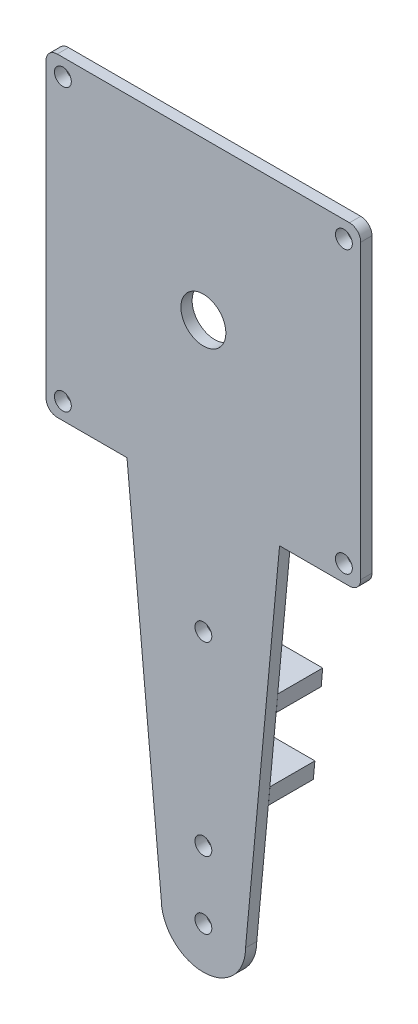
ISO-10303-21;
HEADER;
FILE_DESCRIPTION(('STEP AP214'),'2;1');
FILE_NAME('part.step','',(''),(''),'','','');
FILE_SCHEMA(('AUTOMOTIVE_DESIGN { 1 0 10303 214 1 1 1 1 }'));
ENDSEC;
DATA;
#1=APPLICATION_CONTEXT('core data for automotive mechanical design processes');
#2=APPLICATION_PROTOCOL_DEFINITION('international standard','automotive_design',2000,#1);
#3=PRODUCT_CONTEXT('',#1,'mechanical');
#4=PRODUCT('Part','Part','',(#3));
#5=PRODUCT_RELATED_PRODUCT_CATEGORY('part','',(#4));
#6=PRODUCT_DEFINITION_FORMATION('','',#4);
#7=PRODUCT_DEFINITION_CONTEXT('part definition',#1,'design');
#8=PRODUCT_DEFINITION('design','',#6,#7);
#9=PRODUCT_DEFINITION_SHAPE('','',#8);
#10=(LENGTH_UNIT() NAMED_UNIT(*) SI_UNIT(.MILLI.,.METRE.));
#11=(NAMED_UNIT(*) PLANE_ANGLE_UNIT() SI_UNIT($,.RADIAN.));
#12=(NAMED_UNIT(*) SI_UNIT($,.STERADIAN.) SOLID_ANGLE_UNIT());
#13=UNCERTAINTY_MEASURE_WITH_UNIT(LENGTH_MEASURE(1.E-05),#10,'distance_accuracy_value','');
#14=(GEOMETRIC_REPRESENTATION_CONTEXT(3) GLOBAL_UNCERTAINTY_ASSIGNED_CONTEXT((#13)) GLOBAL_UNIT_ASSIGNED_CONTEXT((#10,
#11,#12)) REPRESENTATION_CONTEXT('',''));
#15=CARTESIAN_POINT('',(0.,0.,0.));
#16=DIRECTION('',(0.,0.,1.));
#17=DIRECTION('',(1.,0.,0.));
#18=AXIS2_PLACEMENT_3D('',#15,#16,#17);
#19=CARTESIAN_POINT('',(26.,26.,0.));
#20=DIRECTION('',(0.,0.,1.));
#21=DIRECTION('',(1.,0.,0.));
#22=AXIS2_PLACEMENT_3D('',#19,#20,#21);
#23=PLANE('',#22);
#24=DIRECTION('',(1.,0.,0.));
#25=VECTOR('',#24,1.);
#26=CARTESIAN_POINT('',(-9.84374999999999,-68.,0.));
#27=LINE('',#26,#25);
#28=CARTESIAN_POINT('',(-9.84374999999999,-68.,0.));
#29=VERTEX_POINT('',#28);
#30=CARTESIAN_POINT('',(9.8291001850641,-68.,0.));
#31=VERTEX_POINT('',#30);
#32=EDGE_CURVE('E55',#29,#31,#27,.T.);
#33=ORIENTED_EDGE('',*,*,#32,.F.);
#34=DIRECTION('',(0.0933407086930583,-0.995634226059288,0.));
#35=VECTOR('',#34,1.);
#36=CARTESIAN_POINT('',(-7.49999999999999,-93.,0.));
#37=LINE('',#36,#35);
#38=CARTESIAN_POINT('',(-10.96875,-56.,0.));
#39=VERTEX_POINT('',#38);
#40=EDGE_CURVE('E215',#39,#29,#37,.T.);
#41=ORIENTED_EDGE('',*,*,#40,.F.);
#42=DIRECTION('',(-1.,0.,0.));
#43=VECTOR('',#42,1.);
#44=CARTESIAN_POINT('',(10.96875,-56.,0.));
#45=LINE('',#44,#43);
#46=CARTESIAN_POINT('',(10.9470682738949,-56.,0.));
#47=VERTEX_POINT('',#46);
#48=EDGE_CURVE('E11',#47,#39,#45,.T.);
#49=ORIENTED_EDGE('',*,*,#48,.F.);
#50=DIRECTION('',(0.0927623104212423,0.995688281424118,0.));
#51=VECTOR('',#50,1.);
#52=CARTESIAN_POINT('',(7.50000000000001,-93.,0.));
#53=LINE('',#52,#51);
#54=EDGE_CURVE('E233',#31,#47,#53,.T.);
#55=ORIENTED_EDGE('',*,*,#54,.F.);
#56=EDGE_LOOP('',(#33,#41,#49,#55));
#57=FACE_BOUND('',#56,.T.);
#58=ADVANCED_FACE('F37',(#57),#23,.F.);
#59=CARTESIAN_POINT('',(0.,-93.,0.));
#60=DIRECTION('',(0.,0.,1.));
#61=DIRECTION('',(1.,0.,0.));
#62=AXIS2_PLACEMENT_3D('',#59,#60,#61);
#63=CIRCLE('',#62,1.5);
#64=CARTESIAN_POINT('',(1.50000000000001,-93.,0.));
#65=VERTEX_POINT('',#64);
#66=EDGE_CURVE('E208',#65,#65,#63,.F.);
#67=ORIENTED_EDGE('',*,*,#66,.F.);
#68=EDGE_LOOP('',(#67));
#69=FACE_BOUND('',#68,.T.);
#70=CARTESIAN_POINT('',(0.,-81.,0.));
#71=DIRECTION('',(0.,0.,-1.));
#72=DIRECTION('',(-1.,0.,0.));
#73=AXIS2_PLACEMENT_3D('',#70,#71,#72);
#74=CIRCLE('',#73,1.5);
#75=CARTESIAN_POINT('',(-1.49999999999998,-81.,0.));
#76=VERTEX_POINT('',#75);
#77=EDGE_CURVE('E804',#76,#76,#74,.T.);
#78=ORIENTED_EDGE('',*,*,#77,.F.);
#79=EDGE_LOOP('',(#78));
#80=FACE_BOUND('',#79,.T.);
#81=CARTESIAN_POINT('',(7.50000000000001,-93.,0.));
#82=VERTEX_POINT('',#81);
#83=CARTESIAN_POINT('',(9.54960816285641,-71.,0.));
#84=VERTEX_POINT('',#83);
#85=EDGE_CURVE('E207',#82,#84,#53,.T.);
#86=ORIENTED_EDGE('',*,*,#85,.F.);
#87=CARTESIAN_POINT('',(0.,-93.,0.));
#88=DIRECTION('',(0.,0.,-1.));
#89=DIRECTION('',(-1.,0.,0.));
#90=AXIS2_PLACEMENT_3D('',#87,#88,#89);
#91=CIRCLE('',#90,7.5);
#92=CARTESIAN_POINT('',(-7.49999999999999,-93.,0.));
#93=VERTEX_POINT('',#92);
#94=EDGE_CURVE('E189',#82,#93,#91,.T.);
#95=ORIENTED_EDGE('',*,*,#94,.T.);
#96=CARTESIAN_POINT('',(-9.56249999999999,-71.,0.));
#97=VERTEX_POINT('',#96);
#98=EDGE_CURVE('E205',#97,#93,#37,.T.);
#99=ORIENTED_EDGE('',*,*,#98,.F.);
#100=DIRECTION('',(-1.,0.,0.));
#101=VECTOR('',#100,1.);
#102=CARTESIAN_POINT('',(9.56250000000001,-71.,0.));
#103=LINE('',#102,#101);
#104=EDGE_CURVE('E830',#84,#97,#103,.T.);
#105=ORIENTED_EDGE('',*,*,#104,.F.);
#106=EDGE_LOOP('',(#86,#95,#99,#105));
#107=FACE_BOUND('',#106,.T.);
#108=ADVANCED_FACE('F203',(#69,#80,#107),#23,.F.);
#109=CARTESIAN_POINT('',(0.,-48.,0.));
#110=DIRECTION('',(0.,0.,-1.));
#111=DIRECTION('',(-1.,0.,0.));
#112=AXIS2_PLACEMENT_3D('',#109,#110,#111);
#113=CIRCLE('',#112,1.5);
#114=CARTESIAN_POINT('',(-1.49999999999999,-48.,0.));
#115=VERTEX_POINT('',#114);
#116=EDGE_CURVE('E808',#115,#115,#113,.T.);
#117=ORIENTED_EDGE('',*,*,#116,.F.);
#118=EDGE_LOOP('',(#117));
#119=FACE_BOUND('',#118,.T.);
#120=CARTESIAN_POINT('',(-25.,25.,0.));
#121=DIRECTION('',(0.,0.,1.));
#122=DIRECTION('',(1.,0.,0.));
#123=AXIS2_PLACEMENT_3D('',#120,#121,#122);
#124=CIRCLE('',#123,1.5);
#125=CARTESIAN_POINT('',(-23.5,25.,0.));
#126=VERTEX_POINT('',#125);
#127=EDGE_CURVE('E279',#126,#126,#124,.T.);
#128=ORIENTED_EDGE('',*,*,#127,.T.);
#129=EDGE_LOOP('',(#128));
#130=FACE_BOUND('',#129,.T.);
#131=CARTESIAN_POINT('',(-25.,-25.,0.));
#132=DIRECTION('',(0.,0.,1.));
#133=DIRECTION('',(1.,0.,0.));
#134=AXIS2_PLACEMENT_3D('',#131,#132,#133);
#135=CIRCLE('',#134,1.5);
#136=CARTESIAN_POINT('',(-23.5,-25.,0.));
#137=VERTEX_POINT('',#136);
#138=EDGE_CURVE('E278',#137,#137,#135,.T.);
#139=ORIENTED_EDGE('',*,*,#138,.T.);
#140=EDGE_LOOP('',(#139));
#141=FACE_BOUND('',#140,.T.);
#142=CARTESIAN_POINT('',(25.,-25.,0.));
#143=DIRECTION('',(0.,0.,1.));
#144=DIRECTION('',(1.,0.,0.));
#145=AXIS2_PLACEMENT_3D('',#142,#143,#144);
#146=CIRCLE('',#145,1.5);
#147=CARTESIAN_POINT('',(26.5,-25.,0.));
#148=VERTEX_POINT('',#147);
#149=EDGE_CURVE('E285',#148,#148,#146,.T.);
#150=ORIENTED_EDGE('',*,*,#149,.T.);
#151=EDGE_LOOP('',(#150));
#152=FACE_BOUND('',#151,.T.);
#153=CARTESIAN_POINT('',(25.,25.,0.));
#154=DIRECTION('',(0.,0.,1.));
#155=DIRECTION('',(1.,0.,0.));
#156=AXIS2_PLACEMENT_3D('',#153,#154,#155);
#157=CIRCLE('',#156,1.5);
#158=CARTESIAN_POINT('',(26.5,25.,0.));
#159=VERTEX_POINT('',#158);
#160=EDGE_CURVE('E291',#159,#159,#157,.T.);
#161=ORIENTED_EDGE('',*,*,#160,.T.);
#162=EDGE_LOOP('',(#161));
#163=FACE_BOUND('',#162,.T.);
#164=CARTESIAN_POINT('',(0.,0.,0.));
#165=DIRECTION('',(0.,0.,1.));
#166=DIRECTION('',(1.,0.,0.));
#167=AXIS2_PLACEMENT_3D('',#164,#165,#166);
#168=CIRCLE('',#167,4.);
#169=CARTESIAN_POINT('',(4.,0.,0.));
#170=VERTEX_POINT('',#169);
#171=EDGE_CURVE('E41',#170,#170,#168,.T.);
#172=ORIENTED_EDGE('',*,*,#171,.T.);
#173=EDGE_LOOP('',(#172));
#174=FACE_BOUND('',#173,.T.);
#175=DIRECTION('',(1.,0.,0.));
#176=VECTOR('',#175,1.);
#177=CARTESIAN_POINT('',(-11.25,-53.,0.));
#178=LINE('',#177,#176);
#179=CARTESIAN_POINT('',(-11.25,-53.,0.));
#180=VERTEX_POINT('',#179);
#181=CARTESIAN_POINT('',(11.226560296088,-53.0000000001623,0.));
#182=VERTEX_POINT('',#181);
#183=EDGE_CURVE('E63',#180,#182,#178,.T.);
#184=ORIENTED_EDGE('',*,*,#183,.F.);
#185=CARTESIAN_POINT('',(-13.59375,-28.,0.));
#186=VERTEX_POINT('',#185);
#187=EDGE_CURVE('E218',#186,#180,#37,.T.);
#188=ORIENTED_EDGE('',*,*,#187,.F.);
#189=DIRECTION('',(1.,0.,0.));
#190=VECTOR('',#189,1.);
#191=CARTESIAN_POINT('',(-13.59375,-28.,0.));
#192=LINE('',#191,#190);
#193=CARTESIAN_POINT('',(-26.,-28.,0.));
#194=VERTEX_POINT('',#193);
#195=EDGE_CURVE('E216',#194,#186,#192,.T.);
#196=ORIENTED_EDGE('',*,*,#195,.F.);
#197=CARTESIAN_POINT('',(-26.,-26.,0.));
#198=DIRECTION('',(0.,0.,1.));
#199=DIRECTION('',(-1.,0.,0.));
#200=AXIS2_PLACEMENT_3D('',#197,#198,#199);
#201=CIRCLE('',#200,2.);
#202=CARTESIAN_POINT('',(-28.,-26.,0.));
#203=VERTEX_POINT('',#202);
#204=EDGE_CURVE('E220',#203,#194,#201,.T.);
#205=ORIENTED_EDGE('',*,*,#204,.F.);
#206=DIRECTION('',(0.,-1.,0.));
#207=VECTOR('',#206,1.);
#208=CARTESIAN_POINT('',(-28.,26.,0.));
#209=LINE('',#208,#207);
#210=CARTESIAN_POINT('',(-28.,26.,0.));
#211=VERTEX_POINT('',#210);
#212=EDGE_CURVE('E331',#211,#203,#209,.T.);
#213=ORIENTED_EDGE('',*,*,#212,.F.);
#214=CARTESIAN_POINT('',(-26.,26.,0.));
#215=DIRECTION('',(0.,0.,1.));
#216=DIRECTION('',(-1.,0.,0.));
#217=AXIS2_PLACEMENT_3D('',#214,#215,#216);
#218=CIRCLE('',#217,2.);
#219=CARTESIAN_POINT('',(-26.,28.,0.));
#220=VERTEX_POINT('',#219);
#221=EDGE_CURVE('E329',#220,#211,#218,.T.);
#222=ORIENTED_EDGE('',*,*,#221,.F.);
#223=DIRECTION('',(-1.,0.,0.));
#224=VECTOR('',#223,1.);
#225=CARTESIAN_POINT('',(26.,28.,0.));
#226=LINE('',#225,#224);
#227=CARTESIAN_POINT('',(26.,28.,0.));
#228=VERTEX_POINT('',#227);
#229=EDGE_CURVE('E327',#228,#220,#226,.T.);
#230=ORIENTED_EDGE('',*,*,#229,.F.);
#231=CARTESIAN_POINT('',(26.,26.,0.));
#232=DIRECTION('',(0.,0.,1.));
#233=DIRECTION('',(1.,0.,0.));
#234=AXIS2_PLACEMENT_3D('',#231,#232,#233);
#235=CIRCLE('',#234,2.);
#236=CARTESIAN_POINT('',(28.,26.,0.));
#237=VERTEX_POINT('',#236);
#238=EDGE_CURVE('E297',#237,#228,#235,.T.);
#239=ORIENTED_EDGE('',*,*,#238,.F.);
#240=DIRECTION('',(0.,1.,0.));
#241=VECTOR('',#240,1.);
#242=CARTESIAN_POINT('',(28.,26.,0.));
#243=LINE('',#242,#241);
#244=CARTESIAN_POINT('',(28.,-26.,0.));
#245=VERTEX_POINT('',#244);
#246=EDGE_CURVE('E304',#245,#237,#243,.T.);
#247=ORIENTED_EDGE('',*,*,#246,.F.);
#248=CARTESIAN_POINT('',(26.,-26.,0.));
#249=DIRECTION('',(0.,0.,1.));
#250=DIRECTION('',(-1.,0.,0.));
#251=AXIS2_PLACEMENT_3D('',#248,#249,#250);
#252=CIRCLE('',#251,2.);
#253=CARTESIAN_POINT('',(26.,-28.,0.));
#254=VERTEX_POINT('',#253);
#255=EDGE_CURVE('E791',#254,#245,#252,.T.);
#256=ORIENTED_EDGE('',*,*,#255,.F.);
#257=DIRECTION('',(1.,0.,0.));
#258=VECTOR('',#257,1.);
#259=CARTESIAN_POINT('',(26.,-28.,0.));
#260=LINE('',#259,#258);
#261=CARTESIAN_POINT('',(13.5556604811666,-28.,0.));
#262=VERTEX_POINT('',#261);
#263=EDGE_CURVE('E236',#262,#254,#260,.T.);
#264=ORIENTED_EDGE('',*,*,#263,.F.);
#265=EDGE_CURVE('E223',#182,#262,#53,.T.);
#266=ORIENTED_EDGE('',*,*,#265,.F.);
#267=EDGE_LOOP('',(#184,#188,#196,#205,#213,#222,#230,#239,#247,#256,#264,#266));
#268=FACE_BOUND('',#267,.T.);
#269=ADVANCED_FACE('F350',(#119,#130,#141,#152,#163,#174,#268),#23,.F.);
#270=CARTESIAN_POINT('',(26.,26.,2.));
#271=DIRECTION('',(0.,0.,1.));
#272=DIRECTION('',(1.,0.,0.));
#273=AXIS2_PLACEMENT_3D('',#270,#271,#272);
#274=PLANE('',#273);
#275=CARTESIAN_POINT('',(0.,-93.,2.));
#276=DIRECTION('',(0.,0.,1.));
#277=DIRECTION('',(1.,0.,0.));
#278=AXIS2_PLACEMENT_3D('',#275,#276,#277);
#279=CIRCLE('',#278,1.5);
#280=CARTESIAN_POINT('',(1.50000000000001,-93.,2.));
#281=VERTEX_POINT('',#280);
#282=EDGE_CURVE('E889',#281,#281,#279,.T.);
#283=ORIENTED_EDGE('',*,*,#282,.F.);
#284=EDGE_LOOP('',(#283));
#285=FACE_BOUND('',#284,.T.);
#286=DIRECTION('',(0.0933407086930583,-0.995634226059288,0.));
#287=VECTOR('',#286,1.);
#288=CARTESIAN_POINT('',(-7.49999999999999,-93.,2.));
#289=LINE('',#288,#287);
#290=CARTESIAN_POINT('',(-13.59375,-28.,2.));
#291=VERTEX_POINT('',#290);
#292=CARTESIAN_POINT('',(-7.49999999999999,-93.,2.));
#293=VERTEX_POINT('',#292);
#294=EDGE_CURVE('E314',#291,#293,#289,.T.);
#295=ORIENTED_EDGE('',*,*,#294,.T.);
#296=CARTESIAN_POINT('',(0.,-93.,2.));
#297=DIRECTION('',(0.,0.,1.));
#298=DIRECTION('',(1.,0.,0.));
#299=AXIS2_PLACEMENT_3D('',#296,#297,#298);
#300=CIRCLE('',#299,7.5);
#301=CARTESIAN_POINT('',(7.50000000000001,-93.,2.));
#302=VERTEX_POINT('',#301);
#303=EDGE_CURVE('E192',#302,#293,#300,.F.);
#304=ORIENTED_EDGE('',*,*,#303,.F.);
#305=DIRECTION('',(0.0927623104212423,0.995688281424118,0.));
#306=VECTOR('',#305,1.);
#307=CARTESIAN_POINT('',(7.50000000000001,-93.,2.));
#308=LINE('',#307,#306);
#309=CARTESIAN_POINT('',(13.5556604811666,-28.,2.));
#310=VERTEX_POINT('',#309);
#311=EDGE_CURVE('E316',#302,#310,#308,.T.);
#312=ORIENTED_EDGE('',*,*,#311,.T.);
#313=DIRECTION('',(1.,0.,0.));
#314=VECTOR('',#313,1.);
#315=CARTESIAN_POINT('',(26.,-28.,2.));
#316=LINE('',#315,#314);
#317=CARTESIAN_POINT('',(26.,-28.,2.));
#318=VERTEX_POINT('',#317);
#319=EDGE_CURVE('E318',#310,#318,#316,.T.);
#320=ORIENTED_EDGE('',*,*,#319,.T.);
#321=CARTESIAN_POINT('',(26.,-26.,2.));
#322=DIRECTION('',(0.,0.,1.));
#323=DIRECTION('',(-1.,0.,0.));
#324=AXIS2_PLACEMENT_3D('',#321,#322,#323);
#325=CIRCLE('',#324,2.);
#326=CARTESIAN_POINT('',(28.,-26.,2.));
#327=VERTEX_POINT('',#326);
#328=EDGE_CURVE('E320',#318,#327,#325,.T.);
#329=ORIENTED_EDGE('',*,*,#328,.T.);
#330=DIRECTION('',(0.,1.,0.));
#331=VECTOR('',#330,1.);
#332=CARTESIAN_POINT('',(28.,26.,2.));
#333=LINE('',#332,#331);
#334=CARTESIAN_POINT('',(28.,26.,2.));
#335=VERTEX_POINT('',#334);
#336=EDGE_CURVE('E322',#327,#335,#333,.T.);
#337=ORIENTED_EDGE('',*,*,#336,.T.);
#338=CARTESIAN_POINT('',(26.,26.,2.));
#339=DIRECTION('',(0.,0.,1.));
#340=DIRECTION('',(1.,0.,0.));
#341=AXIS2_PLACEMENT_3D('',#338,#339,#340);
#342=CIRCLE('',#341,2.);
#343=CARTESIAN_POINT('',(26.,28.,2.));
#344=VERTEX_POINT('',#343);
#345=EDGE_CURVE('E300',#335,#344,#342,.T.);
#346=ORIENTED_EDGE('',*,*,#345,.T.);
#347=DIRECTION('',(-1.,0.,0.));
#348=VECTOR('',#347,1.);
#349=CARTESIAN_POINT('',(26.,28.,2.));
#350=LINE('',#349,#348);
#351=CARTESIAN_POINT('',(-26.,28.,2.));
#352=VERTEX_POINT('',#351);
#353=EDGE_CURVE('E303',#344,#352,#350,.T.);
#354=ORIENTED_EDGE('',*,*,#353,.T.);
#355=CARTESIAN_POINT('',(-26.,26.,2.));
#356=DIRECTION('',(0.,0.,1.));
#357=DIRECTION('',(-1.,0.,0.));
#358=AXIS2_PLACEMENT_3D('',#355,#356,#357);
#359=CIRCLE('',#358,2.);
#360=CARTESIAN_POINT('',(-28.,26.,2.));
#361=VERTEX_POINT('',#360);
#362=EDGE_CURVE('E306',#352,#361,#359,.T.);
#363=ORIENTED_EDGE('',*,*,#362,.T.);
#364=DIRECTION('',(0.,-1.,0.));
#365=VECTOR('',#364,1.);
#366=CARTESIAN_POINT('',(-28.,26.,2.));
#367=LINE('',#366,#365);
#368=CARTESIAN_POINT('',(-28.,-26.,2.));
#369=VERTEX_POINT('',#368);
#370=EDGE_CURVE('E308',#361,#369,#367,.T.);
#371=ORIENTED_EDGE('',*,*,#370,.T.);
#372=CARTESIAN_POINT('',(-26.,-26.,2.));
#373=DIRECTION('',(0.,0.,1.));
#374=DIRECTION('',(-1.,0.,0.));
#375=AXIS2_PLACEMENT_3D('',#372,#373,#374);
#376=CIRCLE('',#375,2.);
#377=CARTESIAN_POINT('',(-26.,-28.,2.));
#378=VERTEX_POINT('',#377);
#379=EDGE_CURVE('E310',#369,#378,#376,.T.);
#380=ORIENTED_EDGE('',*,*,#379,.T.);
#381=DIRECTION('',(1.,0.,0.));
#382=VECTOR('',#381,1.);
#383=CARTESIAN_POINT('',(-13.59375,-28.,2.));
#384=LINE('',#383,#382);
#385=EDGE_CURVE('E312',#378,#291,#384,.T.);
#386=ORIENTED_EDGE('',*,*,#385,.T.);
#387=EDGE_LOOP('',(#295,#304,#312,#320,#329,#337,#346,#354,#363,#371,#380,#386));
#388=FACE_BOUND('',#387,.T.);
#389=CARTESIAN_POINT('',(0.,-48.,2.));
#390=DIRECTION('',(0.,0.,1.));
#391=DIRECTION('',(1.,0.,0.));
#392=AXIS2_PLACEMENT_3D('',#389,#390,#391);
#393=CIRCLE('',#392,1.5);
#394=CARTESIAN_POINT('',(1.50000000000002,-48.,2.));
#395=VERTEX_POINT('',#394);
#396=EDGE_CURVE('E811',#395,#395,#393,.F.);
#397=ORIENTED_EDGE('',*,*,#396,.T.);
#398=EDGE_LOOP('',(#397));
#399=FACE_BOUND('',#398,.T.);
#400=CARTESIAN_POINT('',(0.,-81.,2.));
#401=DIRECTION('',(0.,0.,1.));
#402=DIRECTION('',(1.,0.,0.));
#403=AXIS2_PLACEMENT_3D('',#400,#401,#402);
#404=CIRCLE('',#403,1.5);
#405=CARTESIAN_POINT('',(1.50000000000002,-81.,2.));
#406=VERTEX_POINT('',#405);
#407=EDGE_CURVE('E801',#406,#406,#404,.F.);
#408=ORIENTED_EDGE('',*,*,#407,.T.);
#409=EDGE_LOOP('',(#408));
#410=FACE_BOUND('',#409,.T.);
#411=CARTESIAN_POINT('',(0.,0.,2.));
#412=DIRECTION('',(0.,0.,1.));
#413=DIRECTION('',(1.,0.,0.));
#414=AXIS2_PLACEMENT_3D('',#411,#412,#413);
#415=CIRCLE('',#414,4.);
#416=CARTESIAN_POINT('',(4.,0.,2.));
#417=VERTEX_POINT('',#416);
#418=EDGE_CURVE('E272',#417,#417,#415,.T.);
#419=ORIENTED_EDGE('',*,*,#418,.F.);
#420=EDGE_LOOP('',(#419));
#421=FACE_BOUND('',#420,.T.);
#422=CARTESIAN_POINT('',(-25.,-25.,2.));
#423=DIRECTION('',(0.,0.,1.));
#424=DIRECTION('',(1.,0.,0.));
#425=AXIS2_PLACEMENT_3D('',#422,#423,#424);
#426=CIRCLE('',#425,1.5);
#427=CARTESIAN_POINT('',(-23.5,-25.,2.));
#428=VERTEX_POINT('',#427);
#429=EDGE_CURVE('E282',#428,#428,#426,.T.);
#430=ORIENTED_EDGE('',*,*,#429,.F.);
#431=EDGE_LOOP('',(#430));
#432=FACE_BOUND('',#431,.T.);
#433=CARTESIAN_POINT('',(25.,25.,2.));
#434=DIRECTION('',(0.,0.,1.));
#435=DIRECTION('',(1.,0.,0.));
#436=AXIS2_PLACEMENT_3D('',#433,#434,#435);
#437=CIRCLE('',#436,1.5);
#438=CARTESIAN_POINT('',(26.5,25.,2.));
#439=VERTEX_POINT('',#438);
#440=EDGE_CURVE('E294',#439,#439,#437,.T.);
#441=ORIENTED_EDGE('',*,*,#440,.F.);
#442=EDGE_LOOP('',(#441));
#443=FACE_BOUND('',#442,.T.);
#444=CARTESIAN_POINT('',(25.,-25.,2.));
#445=DIRECTION('',(0.,0.,1.));
#446=DIRECTION('',(1.,0.,0.));
#447=AXIS2_PLACEMENT_3D('',#444,#445,#446);
#448=CIRCLE('',#447,1.5);
#449=CARTESIAN_POINT('',(26.5,-25.,2.));
#450=VERTEX_POINT('',#449);
#451=EDGE_CURVE('E288',#450,#450,#448,.T.);
#452=ORIENTED_EDGE('',*,*,#451,.F.);
#453=EDGE_LOOP('',(#452));
#454=FACE_BOUND('',#453,.T.);
#455=CARTESIAN_POINT('',(-25.,25.,2.));
#456=DIRECTION('',(0.,0.,1.));
#457=DIRECTION('',(1.,0.,0.));
#458=AXIS2_PLACEMENT_3D('',#455,#456,#457);
#459=CIRCLE('',#458,1.5);
#460=CARTESIAN_POINT('',(-23.5,25.,2.));
#461=VERTEX_POINT('',#460);
#462=EDGE_CURVE('E275',#461,#461,#459,.T.);
#463=ORIENTED_EDGE('',*,*,#462,.F.);
#464=EDGE_LOOP('',(#463));
#465=FACE_BOUND('',#464,.T.);
#466=ADVANCED_FACE('F352',(#285,#388,#399,#410,#421,#432,#443,#454,#465),#274,.T.);
#467=CARTESIAN_POINT('',(26.,26.,2.));
#468=DIRECTION('',(0.,0.,-1.));
#469=DIRECTION('',(-1.,0.,0.));
#470=AXIS2_PLACEMENT_3D('',#467,#468,#469);
#471=CYLINDRICAL_SURFACE('',#470,2.);
#472=ORIENTED_EDGE('',*,*,#238,.T.);
#473=DIRECTION('',(0.,0.,-1.));
#474=VECTOR('',#473,1.);
#475=CARTESIAN_POINT('',(26.,28.,2.));
#476=LINE('',#475,#474);
#477=EDGE_CURVE('E46',#344,#228,#476,.T.);
#478=ORIENTED_EDGE('',*,*,#477,.F.);
#479=ORIENTED_EDGE('',*,*,#345,.F.);
#480=DIRECTION('',(0.,0.,-1.));
#481=VECTOR('',#480,1.);
#482=CARTESIAN_POINT('',(28.,26.,2.));
#483=LINE('',#482,#481);
#484=EDGE_CURVE('E324',#335,#237,#483,.T.);
#485=ORIENTED_EDGE('',*,*,#484,.T.);
#486=EDGE_LOOP('',(#472,#478,#479,#485));
#487=FACE_BOUND('',#486,.T.);
#488=ADVANCED_FACE('F39',(#487),#471,.T.);
#489=CARTESIAN_POINT('',(26.,28.,2.));
#490=DIRECTION('',(0.,-1.,0.));
#491=DIRECTION('',(1.,0.,0.));
#492=AXIS2_PLACEMENT_3D('',#489,#490,#491);
#493=PLANE('',#492);
#494=ORIENTED_EDGE('',*,*,#229,.T.);
#495=DIRECTION('',(0.,0.,-1.));
#496=VECTOR('',#495,1.);
#497=CARTESIAN_POINT('',(-26.,28.,2.));
#498=LINE('',#497,#496);
#499=EDGE_CURVE('E772',#352,#220,#498,.T.);
#500=ORIENTED_EDGE('',*,*,#499,.F.);
#501=ORIENTED_EDGE('',*,*,#353,.F.);
#502=ORIENTED_EDGE('',*,*,#477,.T.);
#503=EDGE_LOOP('',(#494,#500,#501,#502));
#504=FACE_BOUND('',#503,.T.);
#505=ADVANCED_FACE('F593',(#504),#493,.F.);
#506=CARTESIAN_POINT('',(-26.,26.,2.));
#507=DIRECTION('',(0.,0.,-1.));
#508=DIRECTION('',(-1.,0.,0.));
#509=AXIS2_PLACEMENT_3D('',#506,#507,#508);
#510=CYLINDRICAL_SURFACE('',#509,2.);
#511=ORIENTED_EDGE('',*,*,#221,.T.);
#512=DIRECTION('',(0.,0.,-1.));
#513=VECTOR('',#512,1.);
#514=CARTESIAN_POINT('',(-28.,26.,2.));
#515=LINE('',#514,#513);
#516=EDGE_CURVE('E773',#361,#211,#515,.T.);
#517=ORIENTED_EDGE('',*,*,#516,.F.);
#518=ORIENTED_EDGE('',*,*,#362,.F.);
#519=ORIENTED_EDGE('',*,*,#499,.T.);
#520=EDGE_LOOP('',(#511,#517,#518,#519));
#521=FACE_BOUND('',#520,.T.);
#522=ADVANCED_FACE('F585',(#521),#510,.T.);
#523=CARTESIAN_POINT('',(-28.,26.,2.));
#524=DIRECTION('',(1.,0.,0.));
#525=DIRECTION('',(0.,1.,0.));
#526=AXIS2_PLACEMENT_3D('',#523,#524,#525);
#527=PLANE('',#526);
#528=ORIENTED_EDGE('',*,*,#212,.T.);
#529=DIRECTION('',(0.,0.,-1.));
#530=VECTOR('',#529,1.);
#531=CARTESIAN_POINT('',(-28.,-26.,2.));
#532=LINE('',#531,#530);
#533=EDGE_CURVE('E343',#369,#203,#532,.T.);
#534=ORIENTED_EDGE('',*,*,#533,.F.);
#535=ORIENTED_EDGE('',*,*,#370,.F.);
#536=ORIENTED_EDGE('',*,*,#516,.T.);
#537=EDGE_LOOP('',(#528,#534,#535,#536));
#538=FACE_BOUND('',#537,.T.);
#539=ADVANCED_FACE('F578',(#538),#527,.F.);
#540=CARTESIAN_POINT('',(-26.,-26.,2.));
#541=DIRECTION('',(0.,0.,-1.));
#542=DIRECTION('',(-1.,0.,0.));
#543=AXIS2_PLACEMENT_3D('',#540,#541,#542);
#544=CYLINDRICAL_SURFACE('',#543,2.);
#545=ORIENTED_EDGE('',*,*,#204,.T.);
#546=DIRECTION('',(0.,0.,-1.));
#547=VECTOR('',#546,1.);
#548=CARTESIAN_POINT('',(-26.,-28.,2.));
#549=LINE('',#548,#547);
#550=EDGE_CURVE('E340',#378,#194,#549,.T.);
#551=ORIENTED_EDGE('',*,*,#550,.F.);
#552=ORIENTED_EDGE('',*,*,#379,.F.);
#553=ORIENTED_EDGE('',*,*,#533,.T.);
#554=EDGE_LOOP('',(#545,#551,#552,#553));
#555=FACE_BOUND('',#554,.T.);
#556=ADVANCED_FACE('F338',(#555),#544,.T.);
#557=CARTESIAN_POINT('',(-13.59375,-28.,2.));
#558=DIRECTION('',(0.,1.,0.));
#559=DIRECTION('',(0.,0.,1.));
#560=AXIS2_PLACEMENT_3D('',#557,#558,#559);
#561=PLANE('',#560);
#562=ORIENTED_EDGE('',*,*,#195,.T.);
#563=DIRECTION('',(0.,0.,-1.));
#564=VECTOR('',#563,1.);
#565=CARTESIAN_POINT('',(-13.59375,-28.,2.));
#566=LINE('',#565,#564);
#567=EDGE_CURVE('E197',#291,#186,#566,.T.);
#568=ORIENTED_EDGE('',*,*,#567,.F.);
#569=ORIENTED_EDGE('',*,*,#385,.F.);
#570=ORIENTED_EDGE('',*,*,#550,.T.);
#571=EDGE_LOOP('',(#562,#568,#569,#570));
#572=FACE_BOUND('',#571,.T.);
#573=ADVANCED_FACE('F347',(#572),#561,.F.);
#574=CARTESIAN_POINT('',(-7.49999999999999,-93.,2.));
#575=DIRECTION('',(0.995634226059288,0.0933407086930583,0.));
#576=DIRECTION('',(-0.0933407086930583,0.995634226059288,0.));
#577=AXIS2_PLACEMENT_3D('',#574,#575,#576);
#578=PLANE('',#577);
#579=ORIENTED_EDGE('',*,*,#187,.T.);
#580=DIRECTION('',(0.,0.,1.));
#581=VECTOR('',#580,1.);
#582=CARTESIAN_POINT('',(-11.25,-53.,-8.));
#583=LINE('',#582,#581);
#584=CARTESIAN_POINT('',(-11.25,-53.,-8.));
#585=VERTEX_POINT('',#584);
#586=EDGE_CURVE('E264',#585,#180,#583,.T.);
#587=ORIENTED_EDGE('',*,*,#586,.F.);
#588=DIRECTION('',(-0.0933407086930583,0.995634226059288,0.));
#589=VECTOR('',#588,1.);
#590=CARTESIAN_POINT('',(-10.96875,-56.,-8.));
#591=LINE('',#590,#589);
#592=CARTESIAN_POINT('',(-10.96875,-56.,-8.));
#593=VERTEX_POINT('',#592);
#594=EDGE_CURVE('E267',#593,#585,#591,.T.);
#595=ORIENTED_EDGE('',*,*,#594,.F.);
#596=DIRECTION('',(0.,0.,1.));
#597=VECTOR('',#596,1.);
#598=CARTESIAN_POINT('',(-10.96875,-56.,-8.));
#599=LINE('',#598,#597);
#600=EDGE_CURVE('E266',#593,#39,#599,.T.);
#601=ORIENTED_EDGE('',*,*,#600,.T.);
#602=ORIENTED_EDGE('',*,*,#40,.T.);
#603=DIRECTION('',(0.,0.,1.));
#604=VECTOR('',#603,1.);
#605=CARTESIAN_POINT('',(-9.84374999999999,-68.,-8.));
#606=LINE('',#605,#604);
#607=CARTESIAN_POINT('',(-9.84374999999999,-68.,-8.));
#608=VERTEX_POINT('',#607);
#609=EDGE_CURVE('E823',#608,#29,#606,.T.);
#610=ORIENTED_EDGE('',*,*,#609,.F.);
#611=DIRECTION('',(-0.0933407086930588,0.995634226059288,0.));
#612=VECTOR('',#611,1.);
#613=CARTESIAN_POINT('',(-9.56249999999999,-71.,-8.));
#614=LINE('',#613,#612);
#615=CARTESIAN_POINT('',(-9.56249999999999,-71.,-8.));
#616=VERTEX_POINT('',#615);
#617=EDGE_CURVE('E825',#616,#608,#614,.T.);
#618=ORIENTED_EDGE('',*,*,#617,.F.);
#619=DIRECTION('',(0.,0.,1.));
#620=VECTOR('',#619,1.);
#621=CARTESIAN_POINT('',(-9.56249999999999,-71.,-8.));
#622=LINE('',#621,#620);
#623=EDGE_CURVE('E214',#616,#97,#622,.T.);
#624=ORIENTED_EDGE('',*,*,#623,.T.);
#625=ORIENTED_EDGE('',*,*,#98,.T.);
#626=DIRECTION('',(0.,0.,-1.));
#627=VECTOR('',#626,1.);
#628=CARTESIAN_POINT('',(-7.49999999999999,-93.,2.));
#629=LINE('',#628,#627);
#630=EDGE_CURVE('E186',#293,#93,#629,.T.);
#631=ORIENTED_EDGE('',*,*,#630,.F.);
#632=ORIENTED_EDGE('',*,*,#294,.F.);
#633=ORIENTED_EDGE('',*,*,#567,.T.);
#634=EDGE_LOOP('',(#579,#587,#595,#601,#602,#610,#618,#624,#625,#631,#632,#633));
#635=FACE_BOUND('',#634,.T.);
#636=ADVANCED_FACE('F211',(#635),#578,.F.);
#637=CARTESIAN_POINT('',(7.50000000000001,-93.,2.));
#638=DIRECTION('',(-0.995688281424118,0.0927623104212423,0.));
#639=DIRECTION('',(-0.0927623104212423,-0.995688281424118,0.));
#640=AXIS2_PLACEMENT_3D('',#637,#638,#639);
#641=PLANE('',#640);
#642=ORIENTED_EDGE('',*,*,#85,.T.);
#643=EDGE_CURVE('E228',#84,#31,#53,.T.);
#644=ORIENTED_EDGE('',*,*,#643,.T.);
#645=ORIENTED_EDGE('',*,*,#54,.T.);
#646=EDGE_CURVE('E227',#47,#182,#53,.T.);
#647=ORIENTED_EDGE('',*,*,#646,.T.);
#648=ORIENTED_EDGE('',*,*,#265,.T.);
#649=DIRECTION('',(0.,0.,-1.));
#650=VECTOR('',#649,1.);
#651=CARTESIAN_POINT('',(13.5556604811666,-28.,2.));
#652=LINE('',#651,#650);
#653=EDGE_CURVE('E781',#310,#262,#652,.T.);
#654=ORIENTED_EDGE('',*,*,#653,.F.);
#655=ORIENTED_EDGE('',*,*,#311,.F.);
#656=DIRECTION('',(0.,0.,-1.));
#657=VECTOR('',#656,1.);
#658=CARTESIAN_POINT('',(7.50000000000001,-93.,2.));
#659=LINE('',#658,#657);
#660=EDGE_CURVE('E198',#302,#82,#659,.T.);
#661=ORIENTED_EDGE('',*,*,#660,.T.);
#662=EDGE_LOOP('',(#642,#644,#645,#647,#648,#654,#655,#661));
#663=FACE_BOUND('',#662,.T.);
#664=ADVANCED_FACE('F239',(#663),#641,.F.);
#665=CARTESIAN_POINT('',(26.,-28.,2.));
#666=DIRECTION('',(0.,1.,0.));
#667=DIRECTION('',(-1.,0.,0.));
#668=AXIS2_PLACEMENT_3D('',#665,#666,#667);
#669=PLANE('',#668);
#670=ORIENTED_EDGE('',*,*,#263,.T.);
#671=DIRECTION('',(0.,0.,-1.));
#672=VECTOR('',#671,1.);
#673=CARTESIAN_POINT('',(26.,-28.,2.));
#674=LINE('',#673,#672);
#675=EDGE_CURVE('E783',#318,#254,#674,.T.);
#676=ORIENTED_EDGE('',*,*,#675,.F.);
#677=ORIENTED_EDGE('',*,*,#319,.F.);
#678=ORIENTED_EDGE('',*,*,#653,.T.);
#679=EDGE_LOOP('',(#670,#676,#677,#678));
#680=FACE_BOUND('',#679,.T.);
#681=ADVANCED_FACE('F547',(#680),#669,.F.);
#682=CARTESIAN_POINT('',(26.,-26.,2.));
#683=DIRECTION('',(0.,0.,-1.));
#684=DIRECTION('',(-1.,0.,0.));
#685=AXIS2_PLACEMENT_3D('',#682,#683,#684);
#686=CYLINDRICAL_SURFACE('',#685,2.);
#687=ORIENTED_EDGE('',*,*,#255,.T.);
#688=DIRECTION('',(0.,0.,-1.));
#689=VECTOR('',#688,1.);
#690=CARTESIAN_POINT('',(28.,-26.,2.));
#691=LINE('',#690,#689);
#692=EDGE_CURVE('E786',#327,#245,#691,.T.);
#693=ORIENTED_EDGE('',*,*,#692,.F.);
#694=ORIENTED_EDGE('',*,*,#328,.F.);
#695=ORIENTED_EDGE('',*,*,#675,.T.);
#696=EDGE_LOOP('',(#687,#693,#694,#695));
#697=FACE_BOUND('',#696,.T.);
#698=ADVANCED_FACE('F540',(#697),#686,.T.);
#699=CARTESIAN_POINT('',(28.,26.,2.));
#700=DIRECTION('',(-1.,0.,0.));
#701=DIRECTION('',(0.,0.,1.));
#702=AXIS2_PLACEMENT_3D('',#699,#700,#701);
#703=PLANE('',#702);
#704=ORIENTED_EDGE('',*,*,#246,.T.);
#705=ORIENTED_EDGE('',*,*,#484,.F.);
#706=ORIENTED_EDGE('',*,*,#336,.F.);
#707=ORIENTED_EDGE('',*,*,#692,.T.);
#708=EDGE_LOOP('',(#704,#705,#706,#707));
#709=FACE_BOUND('',#708,.T.);
#710=ADVANCED_FACE('F532',(#709),#703,.F.);
#711=CARTESIAN_POINT('',(25.,25.,2.));
#712=DIRECTION('',(0.,0.,-1.));
#713=DIRECTION('',(-1.,0.,0.));
#714=AXIS2_PLACEMENT_3D('',#711,#712,#713);
#715=CYLINDRICAL_SURFACE('',#714,1.5);
#716=ORIENTED_EDGE('',*,*,#440,.T.);
#717=EDGE_LOOP('',(#716));
#718=FACE_BOUND('',#717,.T.);
#719=ORIENTED_EDGE('',*,*,#160,.F.);
#720=EDGE_LOOP('',(#719));
#721=FACE_BOUND('',#720,.T.);
#722=ADVANCED_FACE('F524',(#718,#721),#715,.F.);
#723=CARTESIAN_POINT('',(25.,-25.,2.));
#724=DIRECTION('',(0.,0.,-1.));
#725=DIRECTION('',(-1.,0.,0.));
#726=AXIS2_PLACEMENT_3D('',#723,#724,#725);
#727=CYLINDRICAL_SURFACE('',#726,1.5);
#728=ORIENTED_EDGE('',*,*,#451,.T.);
#729=EDGE_LOOP('',(#728));
#730=FACE_BOUND('',#729,.T.);
#731=ORIENTED_EDGE('',*,*,#149,.F.);
#732=EDGE_LOOP('',(#731));
#733=FACE_BOUND('',#732,.T.);
#734=ADVANCED_FACE('F516',(#730,#733),#727,.F.);
#735=CARTESIAN_POINT('',(-25.,-25.,2.));
#736=DIRECTION('',(0.,0.,-1.));
#737=DIRECTION('',(-1.,0.,0.));
#738=AXIS2_PLACEMENT_3D('',#735,#736,#737);
#739=CYLINDRICAL_SURFACE('',#738,1.5);
#740=ORIENTED_EDGE('',*,*,#429,.T.);
#741=EDGE_LOOP('',(#740));
#742=FACE_BOUND('',#741,.T.);
#743=ORIENTED_EDGE('',*,*,#138,.F.);
#744=EDGE_LOOP('',(#743));
#745=FACE_BOUND('',#744,.T.);
#746=ADVANCED_FACE('F508',(#742,#745),#739,.F.);
#747=CARTESIAN_POINT('',(-25.,25.,2.));
#748=DIRECTION('',(0.,0.,-1.));
#749=DIRECTION('',(-1.,0.,0.));
#750=AXIS2_PLACEMENT_3D('',#747,#748,#749);
#751=CYLINDRICAL_SURFACE('',#750,1.5);
#752=ORIENTED_EDGE('',*,*,#462,.T.);
#753=EDGE_LOOP('',(#752));
#754=FACE_BOUND('',#753,.T.);
#755=ORIENTED_EDGE('',*,*,#127,.F.);
#756=EDGE_LOOP('',(#755));
#757=FACE_BOUND('',#756,.T.);
#758=ADVANCED_FACE('F500',(#754,#757),#751,.F.);
#759=CARTESIAN_POINT('',(0.,0.,-8.));
#760=DIRECTION('',(0.,0.,1.));
#761=DIRECTION('',(1.,0.,0.));
#762=AXIS2_PLACEMENT_3D('',#759,#760,#761);
#763=CYLINDRICAL_SURFACE('',#762,4.);
#764=ORIENTED_EDGE('',*,*,#418,.T.);
#765=EDGE_LOOP('',(#764));
#766=FACE_BOUND('',#765,.T.);
#767=ORIENTED_EDGE('',*,*,#171,.F.);
#768=EDGE_LOOP('',(#767));
#769=FACE_BOUND('',#768,.T.);
#770=ADVANCED_FACE('F493',(#766,#769),#763,.F.);
#771=CARTESIAN_POINT('',(-11.25,-53.,-8.));
#772=DIRECTION('',(0.,-1.,0.));
#773=DIRECTION('',(0.,0.,-1.));
#774=AXIS2_PLACEMENT_3D('',#771,#772,#773);
#775=PLANE('',#774);
#776=ORIENTED_EDGE('',*,*,#183,.T.);
#777=DIRECTION('',(0.,0.,1.));
#778=VECTOR('',#777,1.);
#779=CARTESIAN_POINT('',(11.2265602961026,-53.,-8.));
#780=LINE('',#779,#778);
#781=CARTESIAN_POINT('',(11.2265602961026,-53.,-8.));
#782=VERTEX_POINT('',#781);
#783=EDGE_CURVE('E270',#782,#182,#780,.T.);
#784=ORIENTED_EDGE('',*,*,#783,.F.);
#785=DIRECTION('',(1.,0.,0.));
#786=VECTOR('',#785,1.);
#787=CARTESIAN_POINT('',(-11.25,-53.,-8.));
#788=LINE('',#787,#786);
#789=EDGE_CURVE('E257',#585,#782,#788,.T.);
#790=ORIENTED_EDGE('',*,*,#789,.F.);
#791=ORIENTED_EDGE('',*,*,#586,.T.);
#792=EDGE_LOOP('',(#776,#784,#790,#791));
#793=FACE_BOUND('',#792,.T.);
#794=ADVANCED_FACE('F486',(#793),#775,.F.);
#795=CARTESIAN_POINT('',(11.2265602961026,-53.,-8.));
#796=DIRECTION('',(-0.996327763657922,0.0856211852546108,0.));
#797=DIRECTION('',(-0.0856211852546108,-0.996327763657922,0.));
#798=AXIS2_PLACEMENT_3D('',#795,#796,#797);
#799=PLANE('',#798);
#800=DIRECTION('',(-0.0856211852546108,-0.996327763657922,0.));
#801=VECTOR('',#800,1.);
#802=CARTESIAN_POINT('',(11.2265602961026,-53.,0.));
#803=LINE('',#802,#801);
#804=CARTESIAN_POINT('',(10.96875,-56.,0.));
#805=VERTEX_POINT('',#804);
#806=EDGE_CURVE('E250',#182,#805,#803,.T.);
#807=ORIENTED_EDGE('',*,*,#806,.T.);
#808=DIRECTION('',(0.,0.,1.));
#809=VECTOR('',#808,1.);
#810=CARTESIAN_POINT('',(10.96875,-56.,-8.));
#811=LINE('',#810,#809);
#812=CARTESIAN_POINT('',(10.96875,-56.,-8.));
#813=VERTEX_POINT('',#812);
#814=EDGE_CURVE('E256',#813,#805,#811,.T.);
#815=ORIENTED_EDGE('',*,*,#814,.F.);
#816=DIRECTION('',(-0.0856211852546108,-0.996327763657922,0.));
#817=VECTOR('',#816,1.);
#818=CARTESIAN_POINT('',(11.2265602961026,-53.,-8.));
#819=LINE('',#818,#817);
#820=EDGE_CURVE('E259',#782,#813,#819,.T.);
#821=ORIENTED_EDGE('',*,*,#820,.F.);
#822=ORIENTED_EDGE('',*,*,#783,.T.);
#823=EDGE_LOOP('',(#807,#815,#821,#822));
#824=FACE_BOUND('',#823,.T.);
#825=ADVANCED_FACE('F479',(#824),#799,.F.);
#826=CARTESIAN_POINT('',(10.96875,-56.,-8.));
#827=DIRECTION('',(0.,1.,0.));
#828=DIRECTION('',(0.,0.,1.));
#829=AXIS2_PLACEMENT_3D('',#826,#827,#828);
#830=PLANE('',#829);
#831=EDGE_CURVE('E48',#805,#47,#45,.T.);
#832=ORIENTED_EDGE('',*,*,#831,.T.);
#833=ORIENTED_EDGE('',*,*,#48,.T.);
#834=ORIENTED_EDGE('',*,*,#600,.F.);
#835=DIRECTION('',(-1.,0.,0.));
#836=VECTOR('',#835,1.);
#837=CARTESIAN_POINT('',(10.96875,-56.,-8.));
#838=LINE('',#837,#836);
#839=EDGE_CURVE('E843',#813,#593,#838,.T.);
#840=ORIENTED_EDGE('',*,*,#839,.F.);
#841=ORIENTED_EDGE('',*,*,#814,.T.);
#842=EDGE_LOOP('',(#832,#833,#834,#840,#841));
#843=FACE_BOUND('',#842,.T.);
#844=ADVANCED_FACE('F253',(#843),#830,.F.);
#845=CARTESIAN_POINT('',(0.,0.,-8.));
#846=DIRECTION('',(0.,0.,-1.));
#847=DIRECTION('',(-1.,0.,0.));
#848=AXIS2_PLACEMENT_3D('',#845,#846,#847);
#849=PLANE('',#848);
#850=ORIENTED_EDGE('',*,*,#789,.T.);
#851=ORIENTED_EDGE('',*,*,#820,.T.);
#852=ORIENTED_EDGE('',*,*,#839,.T.);
#853=ORIENTED_EDGE('',*,*,#594,.T.);
#854=EDGE_LOOP('',(#850,#851,#852,#853));
#855=FACE_BOUND('',#854,.T.);
#856=ADVANCED_FACE('F465',(#855),#849,.T.);
#857=CARTESIAN_POINT('',(0.,0.,0.));
#858=DIRECTION('',(0.,0.,-1.));
#859=DIRECTION('',(-1.,0.,0.));
#860=AXIS2_PLACEMENT_3D('',#857,#858,#859);
#861=PLANE('',#860);
#862=ORIENTED_EDGE('',*,*,#646,.F.);
#863=ORIENTED_EDGE('',*,*,#831,.F.);
#864=ORIENTED_EDGE('',*,*,#806,.F.);
#865=EDGE_LOOP('',(#862,#863,#864));
#866=FACE_BOUND('',#865,.T.);
#867=ADVANCED_FACE('F249',(#866),#861,.F.);
#868=CARTESIAN_POINT('',(0.,0.,0.));
#869=DIRECTION('',(0.,0.,-1.));
#870=DIRECTION('',(-1.,0.,0.));
#871=AXIS2_PLACEMENT_3D('',#868,#869,#870);
#872=PLANE('',#871);
#873=CARTESIAN_POINT('',(9.84375000000001,-68.,0.));
#874=VERTEX_POINT('',#873);
#875=EDGE_CURVE('E832',#31,#874,#27,.T.);
#876=ORIENTED_EDGE('',*,*,#875,.F.);
#877=ORIENTED_EDGE('',*,*,#643,.F.);
#878=CARTESIAN_POINT('',(9.56250000000001,-71.,0.));
#879=VERTEX_POINT('',#878);
#880=EDGE_CURVE('E826',#879,#84,#103,.T.);
#881=ORIENTED_EDGE('',*,*,#880,.F.);
#882=DIRECTION('',(-0.0933407086930588,-0.995634226059288,0.));
#883=VECTOR('',#882,1.);
#884=CARTESIAN_POINT('',(9.84375000000001,-68.,0.));
#885=LINE('',#884,#883);
#886=EDGE_CURVE('E829',#874,#879,#885,.T.);
#887=ORIENTED_EDGE('',*,*,#886,.F.);
#888=EDGE_LOOP('',(#876,#877,#881,#887));
#889=FACE_BOUND('',#888,.T.);
#890=ADVANCED_FACE('F451',(#889),#872,.F.);
#891=CARTESIAN_POINT('',(-9.84374999999999,-68.,-8.));
#892=DIRECTION('',(0.,-1.,0.));
#893=DIRECTION('',(0.,0.,-1.));
#894=AXIS2_PLACEMENT_3D('',#891,#892,#893);
#895=PLANE('',#894);
#896=ORIENTED_EDGE('',*,*,#32,.T.);
#897=ORIENTED_EDGE('',*,*,#875,.T.);
#898=DIRECTION('',(0.,0.,1.));
#899=VECTOR('',#898,1.);
#900=CARTESIAN_POINT('',(9.84375000000001,-68.,-8.));
#901=LINE('',#900,#899);
#902=CARTESIAN_POINT('',(9.84375000000001,-68.,-8.));
#903=VERTEX_POINT('',#902);
#904=EDGE_CURVE('E813',#903,#874,#901,.T.);
#905=ORIENTED_EDGE('',*,*,#904,.F.);
#906=DIRECTION('',(1.,0.,0.));
#907=VECTOR('',#906,1.);
#908=CARTESIAN_POINT('',(-9.84374999999999,-68.,-8.));
#909=LINE('',#908,#907);
#910=EDGE_CURVE('E839',#608,#903,#909,.T.);
#911=ORIENTED_EDGE('',*,*,#910,.F.);
#912=ORIENTED_EDGE('',*,*,#609,.T.);
#913=EDGE_LOOP('',(#896,#897,#905,#911,#912));
#914=FACE_BOUND('',#913,.T.);
#915=ADVANCED_FACE('F443',(#914),#895,.F.);
#916=CARTESIAN_POINT('',(9.84375000000001,-68.,-8.));
#917=DIRECTION('',(-0.995634226059288,0.0933407086930588,0.));
#918=DIRECTION('',(-0.0933407086930588,-0.995634226059288,0.));
#919=AXIS2_PLACEMENT_3D('',#916,#917,#918);
#920=PLANE('',#919);
#921=ORIENTED_EDGE('',*,*,#886,.T.);
#922=DIRECTION('',(0.,0.,1.));
#923=VECTOR('',#922,1.);
#924=CARTESIAN_POINT('',(9.56250000000001,-71.,-8.));
#925=LINE('',#924,#923);
#926=CARTESIAN_POINT('',(9.56250000000001,-71.,-8.));
#927=VERTEX_POINT('',#926);
#928=EDGE_CURVE('E819',#927,#879,#925,.T.);
#929=ORIENTED_EDGE('',*,*,#928,.F.);
#930=DIRECTION('',(-0.0933407086930588,-0.995634226059288,0.));
#931=VECTOR('',#930,1.);
#932=CARTESIAN_POINT('',(9.84375000000001,-68.,-8.));
#933=LINE('',#932,#931);
#934=EDGE_CURVE('E837',#903,#927,#933,.T.);
#935=ORIENTED_EDGE('',*,*,#934,.F.);
#936=ORIENTED_EDGE('',*,*,#904,.T.);
#937=EDGE_LOOP('',(#921,#929,#935,#936));
#938=FACE_BOUND('',#937,.T.);
#939=ADVANCED_FACE('F435',(#938),#920,.F.);
#940=CARTESIAN_POINT('',(9.56250000000001,-71.,-8.));
#941=DIRECTION('',(0.,1.,0.));
#942=DIRECTION('',(0.,0.,1.));
#943=AXIS2_PLACEMENT_3D('',#940,#941,#942);
#944=PLANE('',#943);
#945=ORIENTED_EDGE('',*,*,#880,.T.);
#946=ORIENTED_EDGE('',*,*,#104,.T.);
#947=ORIENTED_EDGE('',*,*,#623,.F.);
#948=DIRECTION('',(-1.,0.,0.));
#949=VECTOR('',#948,1.);
#950=CARTESIAN_POINT('',(9.56250000000001,-71.,-8.));
#951=LINE('',#950,#949);
#952=EDGE_CURVE('E835',#927,#616,#951,.T.);
#953=ORIENTED_EDGE('',*,*,#952,.F.);
#954=ORIENTED_EDGE('',*,*,#928,.T.);
#955=EDGE_LOOP('',(#945,#946,#947,#953,#954));
#956=FACE_BOUND('',#955,.T.);
#957=ADVANCED_FACE('F427',(#956),#944,.F.);
#958=CARTESIAN_POINT('',(0.,0.,-8.));
#959=DIRECTION('',(0.,0.,-1.));
#960=DIRECTION('',(-1.,0.,0.));
#961=AXIS2_PLACEMENT_3D('',#958,#959,#960);
#962=PLANE('',#961);
#963=ORIENTED_EDGE('',*,*,#910,.T.);
#964=ORIENTED_EDGE('',*,*,#934,.T.);
#965=ORIENTED_EDGE('',*,*,#952,.T.);
#966=ORIENTED_EDGE('',*,*,#617,.T.);
#967=EDGE_LOOP('',(#963,#964,#965,#966));
#968=FACE_BOUND('',#967,.T.);
#969=ADVANCED_FACE('F419',(#968),#962,.T.);
#970=CARTESIAN_POINT('',(0.,-81.,6.24264068711929));
#971=DIRECTION('',(0.,0.,-1.));
#972=DIRECTION('',(-1.,0.,0.));
#973=AXIS2_PLACEMENT_3D('',#970,#971,#972);
#974=CYLINDRICAL_SURFACE('',#973,1.5);
#975=ORIENTED_EDGE('',*,*,#77,.T.);
#976=EDGE_LOOP('',(#975));
#977=FACE_BOUND('',#976,.T.);
#978=ORIENTED_EDGE('',*,*,#407,.F.);
#979=EDGE_LOOP('',(#978));
#980=FACE_BOUND('',#979,.T.);
#981=ADVANCED_FACE('F411',(#977,#980),#974,.F.);
#982=CARTESIAN_POINT('',(0.,-48.,6.24264068711929));
#983=DIRECTION('',(0.,0.,-1.));
#984=DIRECTION('',(-1.,0.,0.));
#985=AXIS2_PLACEMENT_3D('',#982,#983,#984);
#986=CYLINDRICAL_SURFACE('',#985,1.5);
#987=ORIENTED_EDGE('',*,*,#116,.T.);
#988=EDGE_LOOP('',(#987));
#989=FACE_BOUND('',#988,.T.);
#990=ORIENTED_EDGE('',*,*,#396,.F.);
#991=EDGE_LOOP('',(#990));
#992=FACE_BOUND('',#991,.T.);
#993=ADVANCED_FACE('F406',(#989,#992),#986,.F.);
#994=CARTESIAN_POINT('',(0.,-93.,23.2132034355964));
#995=DIRECTION('',(0.,0.,-1.));
#996=DIRECTION('',(-1.,0.,0.));
#997=AXIS2_PLACEMENT_3D('',#994,#995,#996);
#998=CYLINDRICAL_SURFACE('',#997,7.5);
#999=ORIENTED_EDGE('',*,*,#630,.T.);
#1000=ORIENTED_EDGE('',*,*,#94,.F.);
#1001=ORIENTED_EDGE('',*,*,#660,.F.);
#1002=ORIENTED_EDGE('',*,*,#303,.T.);
#1003=EDGE_LOOP('',(#999,#1000,#1001,#1002));
#1004=FACE_BOUND('',#1003,.T.);
#1005=ADVANCED_FACE('F188',(#1004),#998,.T.);
#1006=CARTESIAN_POINT('',(0.,-93.,-4.24264068711929));
#1007=DIRECTION('',(0.,0.,1.));
#1008=DIRECTION('',(1.,0.,0.));
#1009=AXIS2_PLACEMENT_3D('',#1006,#1007,#1008);
#1010=CYLINDRICAL_SURFACE('',#1009,1.5);
#1011=ORIENTED_EDGE('',*,*,#66,.T.);
#1012=EDGE_LOOP('',(#1011));
#1013=FACE_BOUND('',#1012,.T.);
#1014=ORIENTED_EDGE('',*,*,#282,.T.);
#1015=EDGE_LOOP('',(#1014));
#1016=FACE_BOUND('',#1015,.T.);
#1017=ADVANCED_FACE('F394',(#1013,#1016),#1010,.F.);
#1018=CLOSED_SHELL('',(#58,#108,#269,#466,#488,#505,#522,#539,#556,#573,#636,#664,#681,#698,
#710,#722,#734,#746,#758,#770,#794,#825,#844,#856,#867,#890,#915,#939,#957,#969,#981,#993,#1005,#1017));
#1019=MANIFOLD_SOLID_BREP('B2',#1018);
#1020=ADVANCED_BREP_SHAPE_REPRESENTATION('',(#18,#1019),#14);
#1021=SHAPE_DEFINITION_REPRESENTATION(#9,#1020);
ENDSEC;
END-ISO-10303-21;
